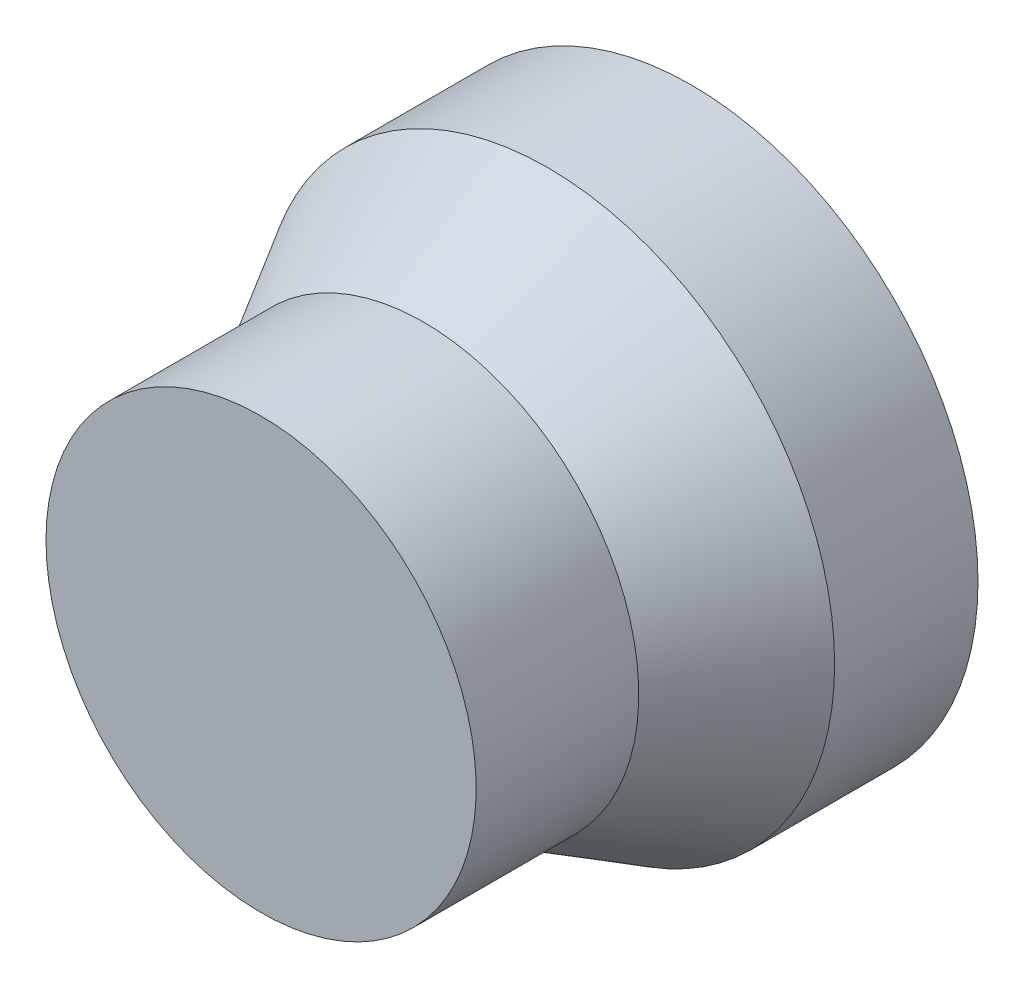
ISO-10303-21;
HEADER;
FILE_DESCRIPTION(('STEP AP214'),'2;1');
FILE_NAME('part.step','',(''),(''),'','','');
FILE_SCHEMA(('AUTOMOTIVE_DESIGN { 1 0 10303 214 1 1 1 1 }'));
ENDSEC;
DATA;
#1=APPLICATION_CONTEXT('core data for automotive mechanical design processes');
#2=APPLICATION_PROTOCOL_DEFINITION('international standard','automotive_design',2000,#1);
#3=PRODUCT_CONTEXT('',#1,'mechanical');
#4=PRODUCT('Part','Part','',(#3));
#5=PRODUCT_RELATED_PRODUCT_CATEGORY('part','',(#4));
#6=PRODUCT_DEFINITION_FORMATION('','',#4);
#7=PRODUCT_DEFINITION_CONTEXT('part definition',#1,'design');
#8=PRODUCT_DEFINITION('design','',#6,#7);
#9=PRODUCT_DEFINITION_SHAPE('','',#8);
#10=(LENGTH_UNIT() NAMED_UNIT(*) SI_UNIT(.MILLI.,.METRE.));
#11=(NAMED_UNIT(*) PLANE_ANGLE_UNIT() SI_UNIT($,.RADIAN.));
#12=(NAMED_UNIT(*) SI_UNIT($,.STERADIAN.) SOLID_ANGLE_UNIT());
#13=UNCERTAINTY_MEASURE_WITH_UNIT(LENGTH_MEASURE(1.E-05),#10,'distance_accuracy_value','');
#14=(GEOMETRIC_REPRESENTATION_CONTEXT(3) GLOBAL_UNCERTAINTY_ASSIGNED_CONTEXT((#13)) GLOBAL_UNIT_ASSIGNED_CONTEXT((#10,
#11,#12)) REPRESENTATION_CONTEXT('',''));
#15=CARTESIAN_POINT('',(0.,0.,0.));
#16=DIRECTION('',(0.,0.,1.));
#17=DIRECTION('',(1.,0.,0.));
#18=AXIS2_PLACEMENT_3D('',#15,#16,#17);
#19=CARTESIAN_POINT('',(0.,0.,150.));
#20=DIRECTION('',(0.,0.,-1.));
#21=DIRECTION('',(-1.,0.,0.));
#22=AXIS2_PLACEMENT_3D('',#19,#20,#21);
#23=PLANE('',#22);
#24=CARTESIAN_POINT('',(0.,0.,150.));
#25=DIRECTION('',(0.,0.,-1.));
#26=DIRECTION('',(-1.,0.,0.));
#27=AXIS2_PLACEMENT_3D('',#24,#25,#26);
#28=CIRCLE('',#27,75.);
#29=CARTESIAN_POINT('',(-75.,0.,150.));
#30=VERTEX_POINT('',#29);
#31=EDGE_CURVE('E10',#30,#30,#28,.T.);
#32=ORIENTED_EDGE('',*,*,#31,.F.);
#33=EDGE_LOOP('',(#32));
#34=FACE_BOUND('',#33,.T.);
#35=ADVANCED_FACE('F33',(#34),#23,.F.);
#36=CARTESIAN_POINT('',(0.,0.,-165.573770491803));
#37=DIRECTION('',(0.,0.,-1.));
#38=DIRECTION('',(-1.,0.,0.));
#39=AXIS2_PLACEMENT_3D('',#36,#37,#38);
#40=CYLINDRICAL_SURFACE('',#39,75.);
#41=CARTESIAN_POINT('',(0.,0.,93.3012701892219));
#42=DIRECTION('',(0.,0.,-1.));
#43=DIRECTION('',(-1.,0.,0.));
#44=AXIS2_PLACEMENT_3D('',#41,#42,#43);
#45=CIRCLE('',#44,75.);
#46=CARTESIAN_POINT('',(-75.,0.,93.3012701892219));
#47=VERTEX_POINT('',#46);
#48=EDGE_CURVE('E39',#47,#47,#45,.T.);
#49=ORIENTED_EDGE('',*,*,#48,.F.);
#50=EDGE_LOOP('',(#49));
#51=FACE_BOUND('',#50,.T.);
#52=ORIENTED_EDGE('',*,*,#31,.T.);
#53=EDGE_LOOP('',(#52));
#54=FACE_BOUND('',#53,.T.);
#55=ADVANCED_FACE('F63',(#51,#54),#40,.T.);
#56=CARTESIAN_POINT('',(0.,0.,93.3012701892219));
#57=DIRECTION('',(0.,0.,-1.));
#58=DIRECTION('',(-1.,0.,0.));
#59=AXIS2_PLACEMENT_3D('',#56,#57,#58);
#60=CONICAL_SURFACE('',#59,75.,0.523598775598299);
#61=CARTESIAN_POINT('',(0.,0.,50.));
#62=DIRECTION('',(0.,0.,-1.));
#63=DIRECTION('',(-1.,0.,0.));
#64=AXIS2_PLACEMENT_3D('',#61,#62,#63);
#65=CIRCLE('',#64,100.);
#66=CARTESIAN_POINT('',(-100.,0.,50.));
#67=VERTEX_POINT('',#66);
#68=EDGE_CURVE('E43',#67,#67,#65,.T.);
#69=ORIENTED_EDGE('',*,*,#68,.F.);
#70=EDGE_LOOP('',(#69));
#71=FACE_BOUND('',#70,.T.);
#72=ORIENTED_EDGE('',*,*,#48,.T.);
#73=EDGE_LOOP('',(#72));
#74=FACE_BOUND('',#73,.T.);
#75=ADVANCED_FACE('F58',(#71,#74),#60,.T.);
#76=CARTESIAN_POINT('',(0.,0.,-165.573770491803));
#77=DIRECTION('',(0.,0.,-1.));
#78=DIRECTION('',(-1.,0.,0.));
#79=AXIS2_PLACEMENT_3D('',#76,#77,#78);
#80=CYLINDRICAL_SURFACE('',#79,100.);
#81=CARTESIAN_POINT('',(0.,0.,0.));
#82=DIRECTION('',(0.,0.,-1.));
#83=DIRECTION('',(-1.,0.,0.));
#84=AXIS2_PLACEMENT_3D('',#81,#82,#83);
#85=CIRCLE('',#84,100.);
#86=CARTESIAN_POINT('',(-100.,0.,0.));
#87=VERTEX_POINT('',#86);
#88=EDGE_CURVE('E47',#87,#87,#85,.T.);
#89=ORIENTED_EDGE('',*,*,#88,.F.);
#90=EDGE_LOOP('',(#89));
#91=FACE_BOUND('',#90,.T.);
#92=ORIENTED_EDGE('',*,*,#68,.T.);
#93=EDGE_LOOP('',(#92));
#94=FACE_BOUND('',#93,.T.);
#95=ADVANCED_FACE('F55',(#91,#94),#80,.T.);
#96=CARTESIAN_POINT('',(100.,0.,0.));
#97=DIRECTION('',(0.,0.,1.));
#98=DIRECTION('',(1.,0.,0.));
#99=AXIS2_PLACEMENT_3D('',#96,#97,#98);
#100=PLANE('',#99);
#101=ORIENTED_EDGE('',*,*,#88,.T.);
#102=EDGE_LOOP('',(#101));
#103=FACE_BOUND('',#102,.T.);
#104=ADVANCED_FACE('F53',(#103),#100,.F.);
#105=CLOSED_SHELL('',(#35,#55,#75,#95,#104));
#106=MANIFOLD_SOLID_BREP('B2',#105);
#107=ADVANCED_BREP_SHAPE_REPRESENTATION('',(#18,#106),#14);
#108=SHAPE_DEFINITION_REPRESENTATION(#9,#107);
ENDSEC;
END-ISO-10303-21;
